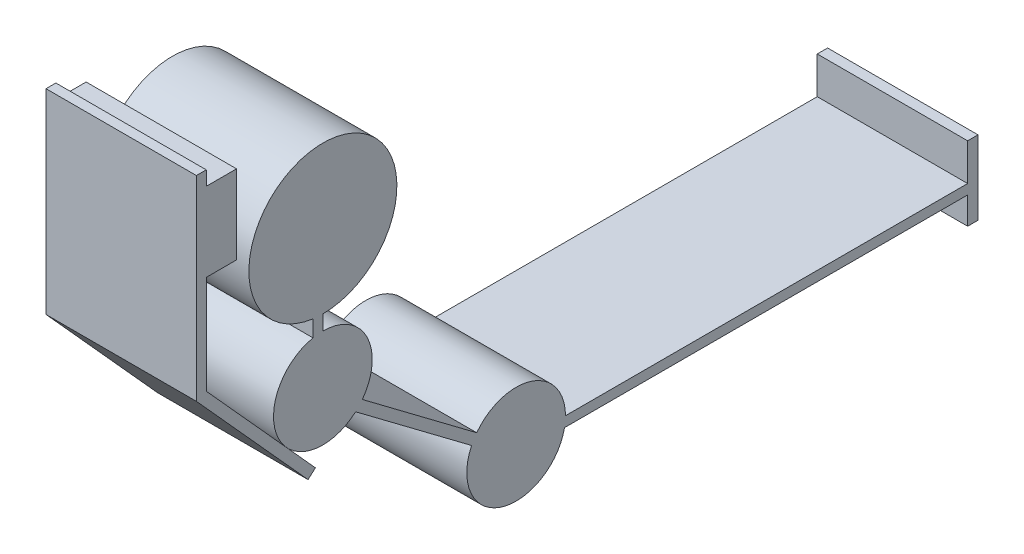
ISO-10303-21;
HEADER;
FILE_DESCRIPTION(('STEP AP214'),'2;1');
FILE_NAME('part.step','',(''),(''),'','','');
FILE_SCHEMA(('AUTOMOTIVE_DESIGN { 1 0 10303 214 1 1 1 1 }'));
ENDSEC;
DATA;
#1=APPLICATION_CONTEXT('core data for automotive mechanical design processes');
#2=APPLICATION_PROTOCOL_DEFINITION('international standard','automotive_design',2000,#1);
#3=PRODUCT_CONTEXT('',#1,'mechanical');
#4=PRODUCT('Part','Part','',(#3));
#5=PRODUCT_RELATED_PRODUCT_CATEGORY('part','',(#4));
#6=PRODUCT_DEFINITION_FORMATION('','',#4);
#7=PRODUCT_DEFINITION_CONTEXT('part definition',#1,'design');
#8=PRODUCT_DEFINITION('design','',#6,#7);
#9=PRODUCT_DEFINITION_SHAPE('','',#8);
#10=(LENGTH_UNIT() NAMED_UNIT(*) SI_UNIT(.MILLI.,.METRE.));
#11=(NAMED_UNIT(*) PLANE_ANGLE_UNIT() SI_UNIT($,.RADIAN.));
#12=(NAMED_UNIT(*) SI_UNIT($,.STERADIAN.) SOLID_ANGLE_UNIT());
#13=UNCERTAINTY_MEASURE_WITH_UNIT(LENGTH_MEASURE(1.E-05),#10,'distance_accuracy_value','');
#14=(GEOMETRIC_REPRESENTATION_CONTEXT(3) GLOBAL_UNCERTAINTY_ASSIGNED_CONTEXT((#13)) GLOBAL_UNIT_ASSIGNED_CONTEXT((#10,
#11,#12)) REPRESENTATION_CONTEXT('',''));
#15=CARTESIAN_POINT('',(0.,0.,0.));
#16=DIRECTION('',(0.,0.,1.));
#17=DIRECTION('',(1.,0.,0.));
#18=AXIS2_PLACEMENT_3D('',#15,#16,#17);
#19=CARTESIAN_POINT('',(304.8,0.,788.372890289523));
#20=DIRECTION('',(0.,0.,-1.));
#21=DIRECTION('',(-1.,0.,0.));
#22=AXIS2_PLACEMENT_3D('',#19,#20,#21);
#23=PLANE('',#22);
#24=DIRECTION('',(0.,-1.,0.));
#25=VECTOR('',#24,1.);
#26=CARTESIAN_POINT('',(0.,0.,788.372890289523));
#27=LINE('',#26,#25);
#28=CARTESIAN_POINT('',(0.,188.904441864782,788.372890289523));
#29=VERTEX_POINT('',#28);
#30=CARTESIAN_POINT('',(0.,158.904441864782,788.372890289523));
#31=VERTEX_POINT('',#30);
#32=EDGE_CURVE('E310',#29,#31,#27,.T.);
#33=ORIENTED_EDGE('',*,*,#32,.F.);
#34=DIRECTION('',(-1.,0.,0.));
#35=VECTOR('',#34,1.);
#36=CARTESIAN_POINT('',(304.8,188.904441864782,788.372890289523));
#37=LINE('',#36,#35);
#38=CARTESIAN_POINT('',(304.8,188.904441864782,788.372890289523));
#39=VERTEX_POINT('',#38);
#40=EDGE_CURVE('E341',#39,#29,#37,.T.);
#41=ORIENTED_EDGE('',*,*,#40,.F.);
#42=DIRECTION('',(0.,-1.,0.));
#43=VECTOR('',#42,1.);
#44=CARTESIAN_POINT('',(304.8,0.,788.372890289523));
#45=LINE('',#44,#43);
#46=CARTESIAN_POINT('',(304.8,158.904441864782,788.372890289523));
#47=VERTEX_POINT('',#46);
#48=EDGE_CURVE('E308',#39,#47,#45,.T.);
#49=ORIENTED_EDGE('',*,*,#48,.T.);
#50=DIRECTION('',(-1.,0.,0.));
#51=VECTOR('',#50,1.);
#52=CARTESIAN_POINT('',(304.8,158.904441864782,788.372890289523));
#53=LINE('',#52,#51);
#54=EDGE_CURVE('E339',#47,#31,#53,.T.);
#55=ORIENTED_EDGE('',*,*,#54,.T.);
#56=EDGE_LOOP('',(#33,#41,#49,#55));
#57=FACE_BOUND('',#56,.T.);
#58=ADVANCED_FACE('F182',(#57),#23,.T.);
#59=CARTESIAN_POINT('',(304.8,58.9044418647818,788.372890289523));
#60=DIRECTION('',(-1.,0.,0.));
#61=DIRECTION('',(0.,0.,1.));
#62=AXIS2_PLACEMENT_3D('',#59,#60,#61);
#63=CYLINDRICAL_SURFACE('',#62,100.);
#64=CARTESIAN_POINT('',(0.,58.9044418647818,788.372890289523));
#65=DIRECTION('',(1.,0.,0.));
#66=DIRECTION('',(0.,0.,-1.));
#67=AXIS2_PLACEMENT_3D('',#64,#65,#66);
#68=CIRCLE('',#67,100.);
#69=CARTESIAN_POINT('',(0.,-1.18830713719755,708.442536121753));
#70=VERTEX_POINT('',#69);
#71=EDGE_CURVE('E345',#70,#31,#68,.T.);
#72=ORIENTED_EDGE('',*,*,#71,.T.);
#73=ORIENTED_EDGE('',*,*,#54,.F.);
#74=CARTESIAN_POINT('',(304.8,58.9044418647818,788.372890289523));
#75=DIRECTION('',(1.,0.,0.));
#76=DIRECTION('',(0.,0.,-1.));
#77=AXIS2_PLACEMENT_3D('',#74,#75,#76);
#78=CIRCLE('',#77,100.);
#79=CARTESIAN_POINT('',(304.8,-1.18830713719755,708.442536121753));
#80=VERTEX_POINT('',#79);
#81=EDGE_CURVE('E371',#80,#47,#78,.T.);
#82=ORIENTED_EDGE('',*,*,#81,.F.);
#83=DIRECTION('',(-1.,0.,0.));
#84=VECTOR('',#83,1.);
#85=CARTESIAN_POINT('',(304.8,-1.18830713719755,708.442536121753));
#86=LINE('',#85,#84);
#87=EDGE_CURVE('E337',#80,#70,#86,.T.);
#88=ORIENTED_EDGE('',*,*,#87,.T.);
#89=EDGE_LOOP('',(#72,#73,#82,#88));
#90=FACE_BOUND('',#89,.T.);
#91=ADVANCED_FACE('F466',(#90),#63,.T.);
#92=CARTESIAN_POINT('',(304.8,-341.040770973571,256.399182299884));
#93=DIRECTION('',(0.,0.799303541677698,-0.600927490019793));
#94=DIRECTION('',(0.,0.600927490019793,0.799303541677698));
#95=AXIS2_PLACEMENT_3D('',#92,#93,#94);
#96=PLANE('',#95);
#97=DIRECTION('',(0.,-0.600927490019793,-0.799303541677698));
#98=VECTOR('',#97,1.);
#99=CARTESIAN_POINT('',(0.,-341.040770973571,256.399182299884));
#100=LINE('',#99,#98);
#101=CARTESIAN_POINT('',(0.,-175.457279242937,476.644509035221));
#102=VERTEX_POINT('',#101);
#103=EDGE_CURVE('E348',#70,#102,#100,.T.);
#104=ORIENTED_EDGE('',*,*,#103,.F.);
#105=ORIENTED_EDGE('',*,*,#87,.F.);
#106=DIRECTION('',(0.,-0.600927490019793,-0.799303541677698));
#107=VECTOR('',#106,1.);
#108=CARTESIAN_POINT('',(304.8,-341.040770973571,256.399182299884));
#109=LINE('',#108,#107);
#110=CARTESIAN_POINT('',(304.8,-175.457279242937,476.644509035221));
#111=VERTEX_POINT('',#110);
#112=EDGE_CURVE('E373',#80,#111,#109,.T.);
#113=ORIENTED_EDGE('',*,*,#112,.T.);
#114=DIRECTION('',(-1.,0.,0.));
#115=VECTOR('',#114,1.);
#116=CARTESIAN_POINT('',(304.8,-175.457279242937,476.644509035221));
#117=LINE('',#116,#115);
#118=EDGE_CURVE('E335',#111,#102,#117,.T.);
#119=ORIENTED_EDGE('',*,*,#118,.T.);
#120=EDGE_LOOP('',(#104,#105,#113,#119));
#121=FACE_BOUND('',#120,.T.);
#122=ADVANCED_FACE('F472',(#121),#96,.T.);
#123=CARTESIAN_POINT('',(304.8,338.904441864782,788.372890289523));
#124=DIRECTION('',(-1.,0.,0.));
#125=DIRECTION('',(0.,0.,1.));
#126=AXIS2_PLACEMENT_3D('',#123,#124,#125);
#127=CYLINDRICAL_SURFACE('',#126,150.);
#128=CARTESIAN_POINT('',(0.,338.904441864782,788.372890289523));
#129=DIRECTION('',(1.,0.,0.));
#130=DIRECTION('',(0.,0.,-1.));
#131=AXIS2_PLACEMENT_3D('',#128,#129,#130);
#132=CIRCLE('',#131,150.);
#133=CARTESIAN_POINT('',(0.,190.243754391597,808.372890289523));
#134=VERTEX_POINT('',#133);
#135=EDGE_CURVE('E313',#29,#134,#132,.T.);
#136=ORIENTED_EDGE('',*,*,#135,.T.);
#137=DIRECTION('',(-1.,0.,0.));
#138=VECTOR('',#137,1.);
#139=CARTESIAN_POINT('',(304.8,190.243754391597,808.372890289523));
#140=LINE('',#139,#138);
#141=CARTESIAN_POINT('',(304.8,190.243754391597,808.372890289523));
#142=VERTEX_POINT('',#141);
#143=EDGE_CURVE('E301',#142,#134,#140,.T.);
#144=ORIENTED_EDGE('',*,*,#143,.F.);
#145=CARTESIAN_POINT('',(304.8,338.904441864782,788.372890289523));
#146=DIRECTION('',(1.,0.,0.));
#147=DIRECTION('',(0.,0.,-1.));
#148=AXIS2_PLACEMENT_3D('',#145,#146,#147);
#149=CIRCLE('',#148,150.);
#150=EDGE_CURVE('E186',#39,#142,#149,.T.);
#151=ORIENTED_EDGE('',*,*,#150,.F.);
#152=ORIENTED_EDGE('',*,*,#40,.T.);
#153=EDGE_LOOP('',(#136,#144,#151,#152));
#154=FACE_BOUND('',#153,.T.);
#155=ADVANCED_FACE('F311',(#154),#127,.T.);
#156=CARTESIAN_POINT('',(304.8,-235.550028244917,396.714154867451));
#157=DIRECTION('',(-1.,0.,0.));
#158=DIRECTION('',(0.,0.,1.));
#159=AXIS2_PLACEMENT_3D('',#156,#157,#158);
#160=CYLINDRICAL_SURFACE('',#159,100.);
#161=CARTESIAN_POINT('',(0.,-235.550028244917,396.714154867451));
#162=DIRECTION('',(1.,0.,0.));
#163=DIRECTION('',(0.,0.,-1.));
#164=AXIS2_PLACEMENT_3D('',#161,#162,#163);
#165=CIRCLE('',#164,100.);
#166=CARTESIAN_POINT('',(0.,-235.550028244917,296.714154867451));
#167=VERTEX_POINT('',#166);
#168=EDGE_CURVE('E351',#167,#102,#165,.T.);
#169=ORIENTED_EDGE('',*,*,#168,.T.);
#170=ORIENTED_EDGE('',*,*,#118,.F.);
#171=CARTESIAN_POINT('',(304.8,-235.550028244917,396.714154867451));
#172=DIRECTION('',(1.,0.,0.));
#173=DIRECTION('',(0.,0.,-1.));
#174=AXIS2_PLACEMENT_3D('',#171,#172,#173);
#175=CIRCLE('',#174,100.);
#176=CARTESIAN_POINT('',(304.8,-235.550028244917,296.714154867451));
#177=VERTEX_POINT('',#176);
#178=EDGE_CURVE('E376',#177,#111,#175,.T.);
#179=ORIENTED_EDGE('',*,*,#178,.F.);
#180=DIRECTION('',(-1.,0.,0.));
#181=VECTOR('',#180,1.);
#182=CARTESIAN_POINT('',(304.8,-235.550028244917,296.714154867451));
#183=LINE('',#182,#181);
#184=EDGE_CURVE('E333',#177,#167,#183,.T.);
#185=ORIENTED_EDGE('',*,*,#184,.T.);
#186=EDGE_LOOP('',(#169,#170,#179,#185));
#187=FACE_BOUND('',#186,.T.);
#188=ADVANCED_FACE('F491',(#187),#160,.T.);
#189=CARTESIAN_POINT('',(304.8,-235.550028244917,396.714154867451));
#190=DIRECTION('',(-1.,0.,0.));
#191=DIRECTION('',(0.,0.,1.));
#192=AXIS2_PLACEMENT_3D('',#189,#190,#191);
#193=CYLINDRICAL_SURFACE('',#192,100.);
#194=CARTESIAN_POINT('',(0.,-235.550028244917,396.714154867451));
#195=DIRECTION('',(1.,0.,0.));
#196=DIRECTION('',(0.,0.,-1.));
#197=AXIS2_PLACEMENT_3D('',#194,#195,#196);
#198=CIRCLE('',#197,100.);
#199=CARTESIAN_POINT('',(0.,-192.657470160074,487.048137736238));
#200=VERTEX_POINT('',#199);
#201=CARTESIAN_POINT('',(0.,-255.550028244917,298.734565156124));
#202=VERTEX_POINT('',#201);
#203=EDGE_CURVE('E360',#200,#202,#198,.T.);
#204=ORIENTED_EDGE('',*,*,#203,.T.);
#205=DIRECTION('',(-1.,0.,0.));
#206=VECTOR('',#205,1.);
#207=CARTESIAN_POINT('',(304.8,-255.550028244917,298.734565156124));
#208=LINE('',#207,#206);
#209=CARTESIAN_POINT('',(304.8,-255.550028244917,298.734565156124));
#210=VERTEX_POINT('',#209);
#211=EDGE_CURVE('E326',#210,#202,#208,.T.);
#212=ORIENTED_EDGE('',*,*,#211,.F.);
#213=CARTESIAN_POINT('',(304.8,-235.550028244917,396.714154867451));
#214=DIRECTION('',(1.,0.,0.));
#215=DIRECTION('',(0.,0.,-1.));
#216=AXIS2_PLACEMENT_3D('',#213,#214,#215);
#217=CIRCLE('',#216,100.);
#218=CARTESIAN_POINT('',(304.8,-192.657470160074,487.048137736238));
#219=VERTEX_POINT('',#218);
#220=EDGE_CURVE('E384',#219,#210,#217,.T.);
#221=ORIENTED_EDGE('',*,*,#220,.F.);
#222=DIRECTION('',(-1.,0.,0.));
#223=VECTOR('',#222,1.);
#224=CARTESIAN_POINT('',(304.8,-192.657470160074,487.048137736238));
#225=LINE('',#224,#223);
#226=EDGE_CURVE('E323',#219,#200,#225,.T.);
#227=ORIENTED_EDGE('',*,*,#226,.T.);
#228=EDGE_LOOP('',(#204,#212,#221,#227));
#229=FACE_BOUND('',#228,.T.);
#230=ADVANCED_FACE('F398',(#229),#193,.T.);
#231=CARTESIAN_POINT('',(304.8,0.,808.372890289523));
#232=DIRECTION('',(0.,0.,-1.));
#233=DIRECTION('',(-1.,0.,0.));
#234=AXIS2_PLACEMENT_3D('',#231,#232,#233);
#235=PLANE('',#234);
#236=DIRECTION('',(0.,-1.,0.));
#237=VECTOR('',#236,1.);
#238=CARTESIAN_POINT('',(0.,0.,808.372890289523));
#239=LINE('',#238,#237);
#240=CARTESIAN_POINT('',(0.,156.884031576109,808.372890289523));
#241=VERTEX_POINT('',#240);
#242=EDGE_CURVE('E366',#134,#241,#239,.T.);
#243=ORIENTED_EDGE('',*,*,#242,.T.);
#244=DIRECTION('',(-1.,0.,0.));
#245=VECTOR('',#244,1.);
#246=CARTESIAN_POINT('',(304.8,156.884031576109,808.372890289523));
#247=LINE('',#246,#245);
#248=CARTESIAN_POINT('',(304.8,156.884031576109,808.372890289523));
#249=VERTEX_POINT('',#248);
#250=EDGE_CURVE('E303',#249,#241,#247,.T.);
#251=ORIENTED_EDGE('',*,*,#250,.F.);
#252=DIRECTION('',(0.,-1.,0.));
#253=VECTOR('',#252,1.);
#254=CARTESIAN_POINT('',(304.8,0.,808.372890289523));
#255=LINE('',#254,#253);
#256=EDGE_CURVE('E296',#142,#249,#255,.T.);
#257=ORIENTED_EDGE('',*,*,#256,.F.);
#258=ORIENTED_EDGE('',*,*,#143,.T.);
#259=EDGE_LOOP('',(#243,#251,#257,#258));
#260=FACE_BOUND('',#259,.T.);
#261=ADVANCED_FACE('F299',(#260),#235,.F.);
#262=CARTESIAN_POINT('',(304.8,-357.026841807125,268.41773210028));
#263=DIRECTION('',(0.,0.799303541677698,-0.600927490019793));
#264=DIRECTION('',(0.,0.600927490019793,0.799303541677698));
#265=AXIS2_PLACEMENT_3D('',#262,#263,#264);
#266=PLANE('',#265);
#267=DIRECTION('',(0.,-0.600927490019793,-0.799303541677698));
#268=VECTOR('',#267,1.);
#269=CARTESIAN_POINT('',(0.,-357.026841807125,268.41773210028));
#270=LINE('',#269,#268);
#271=CARTESIAN_POINT('',(0.,-15.9602578871692,722.076007021527));
#272=VERTEX_POINT('',#271);
#273=EDGE_CURVE('E362',#272,#200,#270,.T.);
#274=ORIENTED_EDGE('',*,*,#273,.T.);
#275=ORIENTED_EDGE('',*,*,#226,.F.);
#276=DIRECTION('',(0.,-0.600927490019793,-0.799303541677698));
#277=VECTOR('',#276,1.);
#278=CARTESIAN_POINT('',(304.8,-357.026841807125,268.41773210028));
#279=LINE('',#278,#277);
#280=CARTESIAN_POINT('',(304.8,-15.9602578871692,722.076007021527));
#281=VERTEX_POINT('',#280);
#282=EDGE_CURVE('E386',#281,#219,#279,.T.);
#283=ORIENTED_EDGE('',*,*,#282,.F.);
#284=DIRECTION('',(-1.,0.,0.));
#285=VECTOR('',#284,1.);
#286=CARTESIAN_POINT('',(304.8,-15.9602578871692,722.076007021527));
#287=LINE('',#286,#285);
#288=EDGE_CURVE('E315',#281,#272,#287,.T.);
#289=ORIENTED_EDGE('',*,*,#288,.T.);
#290=EDGE_LOOP('',(#274,#275,#283,#289));
#291=FACE_BOUND('',#290,.T.);
#292=ADVANCED_FACE('F393',(#291),#266,.F.);
#293=CARTESIAN_POINT('',(0.,0.,0.));
#294=DIRECTION('',(1.,0.,0.));
#295=DIRECTION('',(0.,0.,-1.));
#296=AXIS2_PLACEMENT_3D('',#293,#294,#295);
#297=PLANE('',#296);
#298=ORIENTED_EDGE('',*,*,#135,.F.);
#299=ORIENTED_EDGE('',*,*,#32,.T.);
#300=ORIENTED_EDGE('',*,*,#71,.F.);
#301=ORIENTED_EDGE('',*,*,#103,.T.);
#302=ORIENTED_EDGE('',*,*,#168,.F.);
#303=DIRECTION('',(0.,0.,-1.));
#304=VECTOR('',#303,1.);
#305=CARTESIAN_POINT('',(0.,-235.550028244917,0.));
#306=LINE('',#305,#304);
#307=CARTESIAN_POINT('',(0.,-235.550028244917,-518.285845132549));
#308=VERTEX_POINT('',#307);
#309=EDGE_CURVE('E354',#167,#308,#306,.T.);
#310=ORIENTED_EDGE('',*,*,#309,.T.);
#311=DIRECTION('',(0.,-1.,0.));
#312=VECTOR('',#311,1.);
#313=CARTESIAN_POINT('',(0.,-160.550028244917,-518.285845132549));
#314=LINE('',#313,#312);
#315=CARTESIAN_POINT('',(0.,-160.550028244917,-518.285845132549));
#316=VERTEX_POINT('',#315);
#317=EDGE_CURVE('E424',#316,#308,#314,.T.);
#318=ORIENTED_EDGE('',*,*,#317,.F.);
#319=DIRECTION('',(0.,0.,-1.));
#320=VECTOR('',#319,1.);
#321=CARTESIAN_POINT('',(0.,-160.550028244917,-518.285845132549));
#322=LINE('',#321,#320);
#323=CARTESIAN_POINT('',(0.,-160.550028244917,-539.267073435126));
#324=VERTEX_POINT('',#323);
#325=EDGE_CURVE('E427',#316,#324,#322,.T.);
#326=ORIENTED_EDGE('',*,*,#325,.T.);
#327=DIRECTION('',(0.,-1.,0.));
#328=VECTOR('',#327,1.);
#329=CARTESIAN_POINT('',(0.,-160.550028244917,-539.267073435126));
#330=LINE('',#329,#328);
#331=CARTESIAN_POINT('',(0.,-310.550028244917,-539.267073435126));
#332=VERTEX_POINT('',#331);
#333=EDGE_CURVE('E13',#324,#332,#330,.T.);
#334=ORIENTED_EDGE('',*,*,#333,.T.);
#335=DIRECTION('',(0.,0.,1.));
#336=VECTOR('',#335,1.);
#337=CARTESIAN_POINT('',(0.,-310.550028244917,-539.267073435126));
#338=LINE('',#337,#336);
#339=CARTESIAN_POINT('',(0.,-310.550028244917,-518.285845132549));
#340=VERTEX_POINT('',#339);
#341=EDGE_CURVE('E192',#332,#340,#338,.T.);
#342=ORIENTED_EDGE('',*,*,#341,.T.);
#343=CARTESIAN_POINT('',(0.,-255.550028244917,-518.285845132549));
#344=VERTEX_POINT('',#343);
#345=EDGE_CURVE('E423',#344,#340,#314,.T.);
#346=ORIENTED_EDGE('',*,*,#345,.F.);
#347=DIRECTION('',(0.,0.,-1.));
#348=VECTOR('',#347,1.);
#349=CARTESIAN_POINT('',(0.,-255.550028244917,0.));
#350=LINE('',#349,#348);
#351=EDGE_CURVE('E357',#202,#344,#350,.T.);
#352=ORIENTED_EDGE('',*,*,#351,.F.);
#353=ORIENTED_EDGE('',*,*,#203,.F.);
#354=ORIENTED_EDGE('',*,*,#273,.F.);
#355=CARTESIAN_POINT('',(0.,58.9044418647818,788.372890289523));
#356=DIRECTION('',(1.,0.,0.));
#357=DIRECTION('',(0.,0.,-1.));
#358=AXIS2_PLACEMENT_3D('',#355,#356,#357);
#359=CIRCLE('',#358,100.);
#360=EDGE_CURVE('E364',#241,#272,#359,.T.);
#361=ORIENTED_EDGE('',*,*,#360,.F.);
#362=ORIENTED_EDGE('',*,*,#242,.F.);
#363=EDGE_LOOP('',(#298,#299,#300,#301,#302,#310,#318,#326,#334,#342,#346,#352,#353,#354,#361,#362));
#364=FACE_BOUND('',#363,.T.);
#365=ADVANCED_FACE('F439',(#364),#297,.F.);
#366=CARTESIAN_POINT('',(304.8,0.,0.));
#367=DIRECTION('',(1.,0.,0.));
#368=DIRECTION('',(0.,0.,-1.));
#369=AXIS2_PLACEMENT_3D('',#366,#367,#368);
#370=PLANE('',#369);
#371=ORIENTED_EDGE('',*,*,#150,.T.);
#372=ORIENTED_EDGE('',*,*,#256,.T.);
#373=CARTESIAN_POINT('',(304.8,58.9044418647818,788.372890289523));
#374=DIRECTION('',(1.,0.,0.));
#375=DIRECTION('',(0.,0.,-1.));
#376=AXIS2_PLACEMENT_3D('',#373,#374,#375);
#377=CIRCLE('',#376,100.);
#378=EDGE_CURVE('E290',#249,#281,#377,.T.);
#379=ORIENTED_EDGE('',*,*,#378,.T.);
#380=ORIENTED_EDGE('',*,*,#282,.T.);
#381=ORIENTED_EDGE('',*,*,#220,.T.);
#382=DIRECTION('',(0.,0.,-1.));
#383=VECTOR('',#382,1.);
#384=CARTESIAN_POINT('',(304.8,-255.550028244917,0.));
#385=LINE('',#384,#383);
#386=CARTESIAN_POINT('',(304.8,-255.550028244917,-518.285845132549));
#387=VERTEX_POINT('',#386);
#388=EDGE_CURVE('E381',#210,#387,#385,.T.);
#389=ORIENTED_EDGE('',*,*,#388,.T.);
#390=DIRECTION('',(0.,-1.,0.));
#391=VECTOR('',#390,1.);
#392=CARTESIAN_POINT('',(304.8,-160.550028244917,-518.285845132549));
#393=LINE('',#392,#391);
#394=CARTESIAN_POINT('',(304.8,-310.550028244917,-518.285845132549));
#395=VERTEX_POINT('',#394);
#396=EDGE_CURVE('E402',#387,#395,#393,.T.);
#397=ORIENTED_EDGE('',*,*,#396,.T.);
#398=DIRECTION('',(0.,0.,1.));
#399=VECTOR('',#398,1.);
#400=CARTESIAN_POINT('',(304.8,-310.550028244917,-539.267073435126));
#401=LINE('',#400,#399);
#402=CARTESIAN_POINT('',(304.8,-310.550028244917,-539.267073435126));
#403=VERTEX_POINT('',#402);
#404=EDGE_CURVE('E413',#403,#395,#401,.T.);
#405=ORIENTED_EDGE('',*,*,#404,.F.);
#406=DIRECTION('',(0.,-1.,0.));
#407=VECTOR('',#406,1.);
#408=CARTESIAN_POINT('',(304.8,-160.550028244917,-539.267073435126));
#409=LINE('',#408,#407);
#410=CARTESIAN_POINT('',(304.8,-160.550028244917,-539.267073435126));
#411=VERTEX_POINT('',#410);
#412=EDGE_CURVE('E318',#411,#403,#409,.T.);
#413=ORIENTED_EDGE('',*,*,#412,.F.);
#414=DIRECTION('',(0.,0.,-1.));
#415=VECTOR('',#414,1.);
#416=CARTESIAN_POINT('',(304.8,-160.550028244917,-518.285845132549));
#417=LINE('',#416,#415);
#418=CARTESIAN_POINT('',(304.8,-160.550028244917,-518.285845132549));
#419=VERTEX_POINT('',#418);
#420=EDGE_CURVE('E417',#419,#411,#417,.T.);
#421=ORIENTED_EDGE('',*,*,#420,.F.);
#422=CARTESIAN_POINT('',(304.8,-235.550028244917,-518.285845132549));
#423=VERTEX_POINT('',#422);
#424=EDGE_CURVE('E414',#419,#423,#393,.T.);
#425=ORIENTED_EDGE('',*,*,#424,.T.);
#426=DIRECTION('',(0.,0.,-1.));
#427=VECTOR('',#426,1.);
#428=CARTESIAN_POINT('',(304.8,-235.550028244917,0.));
#429=LINE('',#428,#427);
#430=EDGE_CURVE('E378',#177,#423,#429,.T.);
#431=ORIENTED_EDGE('',*,*,#430,.F.);
#432=ORIENTED_EDGE('',*,*,#178,.T.);
#433=ORIENTED_EDGE('',*,*,#112,.F.);
#434=ORIENTED_EDGE('',*,*,#81,.T.);
#435=ORIENTED_EDGE('',*,*,#48,.F.);
#436=EDGE_LOOP('',(#371,#372,#379,#380,#381,#389,#397,#405,#413,#421,#425,#431,#432,#433,#434,#435));
#437=FACE_BOUND('',#436,.T.);
#438=ADVANCED_FACE('F184',(#437),#370,.T.);
#439=CARTESIAN_POINT('',(304.8,58.9044418647818,788.372890289523));
#440=DIRECTION('',(-1.,0.,0.));
#441=DIRECTION('',(0.,0.,1.));
#442=AXIS2_PLACEMENT_3D('',#439,#440,#441);
#443=CYLINDRICAL_SURFACE('',#442,100.);
#444=ORIENTED_EDGE('',*,*,#378,.F.);
#445=ORIENTED_EDGE('',*,*,#250,.T.);
#446=ORIENTED_EDGE('',*,*,#360,.T.);
#447=ORIENTED_EDGE('',*,*,#288,.F.);
#448=EDGE_LOOP('',(#444,#445,#446,#447));
#449=FACE_BOUND('',#448,.T.);
#450=ADVANCED_FACE('F390',(#449),#443,.T.);
#451=CARTESIAN_POINT('',(304.8,-255.550028244917,0.));
#452=DIRECTION('',(0.,1.,0.));
#453=DIRECTION('',(0.,0.,1.));
#454=AXIS2_PLACEMENT_3D('',#451,#452,#453);
#455=PLANE('',#454);
#456=ORIENTED_EDGE('',*,*,#351,.T.);
#457=DIRECTION('',(-1.,0.,0.));
#458=VECTOR('',#457,1.);
#459=CARTESIAN_POINT('',(304.8,-255.550028244917,-518.285845132549));
#460=LINE('',#459,#458);
#461=EDGE_CURVE('E329',#387,#344,#460,.T.);
#462=ORIENTED_EDGE('',*,*,#461,.F.);
#463=ORIENTED_EDGE('',*,*,#388,.F.);
#464=ORIENTED_EDGE('',*,*,#211,.T.);
#465=EDGE_LOOP('',(#456,#462,#463,#464));
#466=FACE_BOUND('',#465,.T.);
#467=ADVANCED_FACE('F405',(#466),#455,.F.);
#468=CARTESIAN_POINT('',(304.8,-235.550028244917,0.));
#469=DIRECTION('',(0.,1.,0.));
#470=DIRECTION('',(0.,0.,1.));
#471=AXIS2_PLACEMENT_3D('',#468,#469,#470);
#472=PLANE('',#471);
#473=ORIENTED_EDGE('',*,*,#309,.F.);
#474=ORIENTED_EDGE('',*,*,#184,.F.);
#475=ORIENTED_EDGE('',*,*,#430,.T.);
#476=DIRECTION('',(-1.,0.,0.));
#477=VECTOR('',#476,1.);
#478=CARTESIAN_POINT('',(304.8,-235.550028244917,-518.285845132549));
#479=LINE('',#478,#477);
#480=EDGE_CURVE('E331',#423,#308,#479,.T.);
#481=ORIENTED_EDGE('',*,*,#480,.T.);
#482=EDGE_LOOP('',(#473,#474,#475,#481));
#483=FACE_BOUND('',#482,.T.);
#484=ADVANCED_FACE('F460',(#483),#472,.T.);
#485=CARTESIAN_POINT('',(304.8,-160.550028244917,-539.267073435126));
#486=DIRECTION('',(0.,0.,-1.));
#487=DIRECTION('',(-1.,0.,0.));
#488=AXIS2_PLACEMENT_3D('',#485,#486,#487);
#489=PLANE('',#488);
#490=ORIENTED_EDGE('',*,*,#333,.F.);
#491=DIRECTION('',(-1.,0.,0.));
#492=VECTOR('',#491,1.);
#493=CARTESIAN_POINT('',(304.8,-160.550028244917,-539.267073435126));
#494=LINE('',#493,#492);
#495=EDGE_CURVE('E369',#411,#324,#494,.T.);
#496=ORIENTED_EDGE('',*,*,#495,.F.);
#497=ORIENTED_EDGE('',*,*,#412,.T.);
#498=DIRECTION('',(-1.,0.,0.));
#499=VECTOR('',#498,1.);
#500=CARTESIAN_POINT('',(304.8,-310.550028244917,-539.267073435126));
#501=LINE('',#500,#499);
#502=EDGE_CURVE('E201',#403,#332,#501,.T.);
#503=ORIENTED_EDGE('',*,*,#502,.T.);
#504=EDGE_LOOP('',(#490,#496,#497,#503));
#505=FACE_BOUND('',#504,.T.);
#506=ADVANCED_FACE('F442',(#505),#489,.T.);
#507=CARTESIAN_POINT('',(304.8,-160.550028244917,-518.285845132549));
#508=DIRECTION('',(0.,1.,0.));
#509=DIRECTION('',(0.,0.,1.));
#510=AXIS2_PLACEMENT_3D('',#507,#508,#509);
#511=PLANE('',#510);
#512=ORIENTED_EDGE('',*,*,#325,.F.);
#513=DIRECTION('',(-1.,0.,0.));
#514=VECTOR('',#513,1.);
#515=CARTESIAN_POINT('',(304.8,-160.550028244917,-518.285845132549));
#516=LINE('',#515,#514);
#517=EDGE_CURVE('E432',#419,#316,#516,.T.);
#518=ORIENTED_EDGE('',*,*,#517,.F.);
#519=ORIENTED_EDGE('',*,*,#420,.T.);
#520=ORIENTED_EDGE('',*,*,#495,.T.);
#521=EDGE_LOOP('',(#512,#518,#519,#520));
#522=FACE_BOUND('',#521,.T.);
#523=ADVANCED_FACE('F452',(#522),#511,.T.);
#524=CARTESIAN_POINT('',(304.8,-310.550028244917,-539.267073435126));
#525=DIRECTION('',(0.,-1.,0.));
#526=DIRECTION('',(0.,0.,-1.));
#527=AXIS2_PLACEMENT_3D('',#524,#525,#526);
#528=PLANE('',#527);
#529=ORIENTED_EDGE('',*,*,#341,.F.);
#530=ORIENTED_EDGE('',*,*,#502,.F.);
#531=ORIENTED_EDGE('',*,*,#404,.T.);
#532=DIRECTION('',(-1.,0.,0.));
#533=VECTOR('',#532,1.);
#534=CARTESIAN_POINT('',(304.8,-310.550028244917,-518.285845132549));
#535=LINE('',#534,#533);
#536=EDGE_CURVE('E411',#395,#340,#535,.T.);
#537=ORIENTED_EDGE('',*,*,#536,.T.);
#538=EDGE_LOOP('',(#529,#530,#531,#537));
#539=FACE_BOUND('',#538,.T.);
#540=ADVANCED_FACE('F437',(#539),#528,.T.);
#541=CARTESIAN_POINT('',(304.8,-160.550028244917,-518.285845132549));
#542=DIRECTION('',(0.,0.,-1.));
#543=DIRECTION('',(-1.,0.,0.));
#544=AXIS2_PLACEMENT_3D('',#541,#542,#543);
#545=PLANE('',#544);
#546=ORIENTED_EDGE('',*,*,#396,.F.);
#547=ORIENTED_EDGE('',*,*,#461,.T.);
#548=ORIENTED_EDGE('',*,*,#345,.T.);
#549=ORIENTED_EDGE('',*,*,#536,.F.);
#550=EDGE_LOOP('',(#546,#547,#548,#549));
#551=FACE_BOUND('',#550,.T.);
#552=ADVANCED_FACE('F409',(#551),#545,.F.);
#553=ORIENTED_EDGE('',*,*,#480,.F.);
#554=ORIENTED_EDGE('',*,*,#424,.F.);
#555=ORIENTED_EDGE('',*,*,#517,.T.);
#556=ORIENTED_EDGE('',*,*,#317,.T.);
#557=EDGE_LOOP('',(#553,#554,#555,#556));
#558=FACE_BOUND('',#557,.T.);
#559=ADVANCED_FACE('F448',(#558),#545,.F.);
#560=CLOSED_SHELL('',(#58,#91,#122,#155,#188,#230,#261,#292,#365,#438,#450,#467,#484,#506,#523,
#540,#552,#559));
#561=MANIFOLD_SOLID_BREP('B2',#560);
#562=CARTESIAN_POINT('',(304.8,171.391607246087,1024.68874642515));
#563=DIRECTION('',(0.,0.67020040640593,-0.742180177081904));
#564=DIRECTION('',(0.,0.742180177081904,0.67020040640593));
#565=AXIS2_PLACEMENT_3D('',#562,#563,#564);
#566=PLANE('',#565);
#567=DIRECTION('',(-1.,0.,0.));
#568=VECTOR('',#567,1.);
#569=CARTESIAN_POINT('',(304.8,-73.5202398105865,803.529485507709));
#570=LINE('',#569,#568);
#571=CARTESIAN_POINT('',(304.8,-73.5202398105865,803.529485507709));
#572=VERTEX_POINT('',#571);
#573=CARTESIAN_POINT('',(0.,-73.5202398105865,803.529485507709));
#574=VERTEX_POINT('',#573);
#575=EDGE_CURVE('E772',#572,#574,#570,.T.);
#576=ORIENTED_EDGE('',*,*,#575,.T.);
#577=DIRECTION('',(0.,-0.742180177081904,-0.67020040640593));
#578=VECTOR('',#577,1.);
#579=CARTESIAN_POINT('',(0.,171.391607246087,1024.68874642515));
#580=LINE('',#579,#578);
#581=CARTESIAN_POINT('',(0.,171.391607246087,1024.68874642515));
#582=VERTEX_POINT('',#581);
#583=EDGE_CURVE('E756',#582,#574,#580,.T.);
#584=ORIENTED_EDGE('',*,*,#583,.F.);
#585=DIRECTION('',(-1.,0.,0.));
#586=VECTOR('',#585,1.);
#587=CARTESIAN_POINT('',(304.8,171.391607246087,1024.68874642515));
#588=LINE('',#587,#586);
#589=CARTESIAN_POINT('',(304.8,171.391607246087,1024.68874642515));
#590=VERTEX_POINT('',#589);
#591=EDGE_CURVE('E770',#590,#582,#588,.T.);
#592=ORIENTED_EDGE('',*,*,#591,.F.);
#593=DIRECTION('',(0.,-0.742180177081904,-0.67020040640593));
#594=VECTOR('',#593,1.);
#595=CARTESIAN_POINT('',(304.8,171.391607246087,1024.68874642515));
#596=LINE('',#595,#594);
#597=EDGE_CURVE('E800',#590,#572,#596,.T.);
#598=ORIENTED_EDGE('',*,*,#597,.T.);
#599=EDGE_LOOP('',(#576,#584,#592,#598));
#600=FACE_BOUND('',#599,.T.);
#601=ADVANCED_FACE('F656',(#600),#566,.T.);
#602=CARTESIAN_POINT('',(304.8,371.220407618039,0.));
#603=DIRECTION('',(0.,-1.,0.));
#604=DIRECTION('',(0.,0.,-1.));
#605=AXIS2_PLACEMENT_3D('',#602,#603,#604);
#606=PLANE('',#605);
#607=DIRECTION('',(0.,0.,1.));
#608=VECTOR('',#607,1.);
#609=CARTESIAN_POINT('',(0.,371.220407618039,0.));
#610=LINE('',#609,#608);
#611=CARTESIAN_POINT('',(0.,371.220407618039,963.372890289523));
#612=VERTEX_POINT('',#611);
#613=CARTESIAN_POINT('',(0.,371.220407618039,1024.68874642515));
#614=VERTEX_POINT('',#613);
#615=EDGE_CURVE('E777',#612,#614,#610,.T.);
#616=ORIENTED_EDGE('',*,*,#615,.F.);
#617=DIRECTION('',(-1.,0.,0.));
#618=VECTOR('',#617,1.);
#619=CARTESIAN_POINT('',(304.8,371.220407618039,963.372890289523));
#620=LINE('',#619,#618);
#621=CARTESIAN_POINT('',(304.8,371.220407618039,963.372890289523));
#622=VERTEX_POINT('',#621);
#623=EDGE_CURVE('E180',#622,#612,#620,.T.);
#624=ORIENTED_EDGE('',*,*,#623,.F.);
#625=DIRECTION('',(0.,0.,1.));
#626=VECTOR('',#625,1.);
#627=CARTESIAN_POINT('',(304.8,371.220407618039,0.));
#628=LINE('',#627,#626);
#629=CARTESIAN_POINT('',(304.8,371.220407618039,1024.68874642515));
#630=VERTEX_POINT('',#629);
#631=EDGE_CURVE('E791',#622,#630,#628,.T.);
#632=ORIENTED_EDGE('',*,*,#631,.T.);
#633=DIRECTION('',(-1.,0.,0.));
#634=VECTOR('',#633,1.);
#635=CARTESIAN_POINT('',(304.8,371.220407618039,1024.68874642515));
#636=LINE('',#635,#634);
#637=EDGE_CURVE('E675',#630,#614,#636,.T.);
#638=ORIENTED_EDGE('',*,*,#637,.T.);
#639=EDGE_LOOP('',(#616,#624,#632,#638));
#640=FACE_BOUND('',#639,.T.);
#641=ADVANCED_FACE('F832',(#640),#606,.T.);
#642=CARTESIAN_POINT('',(304.8,-6.69102392160458E-13,963.372890289523));
#643=DIRECTION('',(0.,0.,-1.));
#644=DIRECTION('',(0.,1.,0.));
#645=AXIS2_PLACEMENT_3D('',#642,#643,#644);
#646=PLANE('',#645);
#647=DIRECTION('',(0.,-1.,0.));
#648=VECTOR('',#647,1.);
#649=CARTESIAN_POINT('',(0.,-6.69102392160458E-13,963.372890289523));
#650=LINE('',#649,#648);
#651=CARTESIAN_POINT('',(0.,531.070196922428,963.372890289523));
#652=VERTEX_POINT('',#651);
#653=EDGE_CURVE('E779',#652,#612,#650,.T.);
#654=ORIENTED_EDGE('',*,*,#653,.F.);
#655=DIRECTION('',(-1.,0.,0.));
#656=VECTOR('',#655,1.);
#657=CARTESIAN_POINT('',(304.8,531.070196922428,963.372890289523));
#658=LINE('',#657,#656);
#659=CARTESIAN_POINT('',(304.8,531.070196922428,963.372890289523));
#660=VERTEX_POINT('',#659);
#661=EDGE_CURVE('E666',#660,#652,#658,.T.);
#662=ORIENTED_EDGE('',*,*,#661,.F.);
#663=DIRECTION('',(0.,-1.,0.));
#664=VECTOR('',#663,1.);
#665=CARTESIAN_POINT('',(304.8,-6.69102392160458E-13,963.372890289523));
#666=LINE('',#665,#664);
#667=EDGE_CURVE('E829',#660,#622,#666,.T.);
#668=ORIENTED_EDGE('',*,*,#667,.T.);
#669=ORIENTED_EDGE('',*,*,#623,.T.);
#670=EDGE_LOOP('',(#654,#662,#668,#669));
#671=FACE_BOUND('',#670,.T.);
#672=ADVANCED_FACE('F827',(#671),#646,.T.);
#673=CARTESIAN_POINT('',(304.8,531.070196922428,0.));
#674=DIRECTION('',(0.,1.,0.));
#675=DIRECTION('',(0.,0.,1.));
#676=AXIS2_PLACEMENT_3D('',#673,#674,#675);
#677=PLANE('',#676);
#678=DIRECTION('',(0.,0.,-1.));
#679=VECTOR('',#678,1.);
#680=CARTESIAN_POINT('',(0.,531.070196922428,0.));
#681=LINE('',#680,#679);
#682=CARTESIAN_POINT('',(0.,531.070196922428,1024.68874642515));
#683=VERTEX_POINT('',#682);
#684=EDGE_CURVE('E783',#683,#652,#681,.T.);
#685=ORIENTED_EDGE('',*,*,#684,.F.);
#686=DIRECTION('',(-1.,0.,0.));
#687=VECTOR('',#686,1.);
#688=CARTESIAN_POINT('',(304.8,531.070196922428,1024.68874642515));
#689=LINE('',#688,#687);
#690=CARTESIAN_POINT('',(304.8,531.070196922428,1024.68874642515));
#691=VERTEX_POINT('',#690);
#692=EDGE_CURVE('E793',#691,#683,#689,.T.);
#693=ORIENTED_EDGE('',*,*,#692,.F.);
#694=DIRECTION('',(0.,0.,-1.));
#695=VECTOR('',#694,1.);
#696=CARTESIAN_POINT('',(304.8,531.070196922428,0.));
#697=LINE('',#696,#695);
#698=EDGE_CURVE('E786',#691,#660,#697,.T.);
#699=ORIENTED_EDGE('',*,*,#698,.T.);
#700=ORIENTED_EDGE('',*,*,#661,.T.);
#701=EDGE_LOOP('',(#685,#693,#699,#700));
#702=FACE_BOUND('',#701,.T.);
#703=ADVANCED_FACE('F822',(#702),#677,.T.);
#704=CARTESIAN_POINT('',(304.8,0.,0.));
#705=DIRECTION('',(1.,0.,0.));
#706=DIRECTION('',(0.,0.,-1.));
#707=AXIS2_PLACEMENT_3D('',#704,#705,#706);
#708=PLANE('',#707);
#709=ORIENTED_EDGE('',*,*,#631,.F.);
#710=ORIENTED_EDGE('',*,*,#667,.F.);
#711=ORIENTED_EDGE('',*,*,#698,.F.);
#712=DIRECTION('',(0.,-1.,0.));
#713=VECTOR('',#712,1.);
#714=CARTESIAN_POINT('',(304.8,559.971929091038,1024.68874642515));
#715=LINE('',#714,#713);
#716=CARTESIAN_POINT('',(304.8,559.971929091038,1024.68874642515));
#717=VERTEX_POINT('',#716);
#718=EDGE_CURVE('E803',#717,#691,#715,.T.);
#719=ORIENTED_EDGE('',*,*,#718,.F.);
#720=DIRECTION('',(0.,0.,-1.));
#721=VECTOR('',#720,1.);
#722=CARTESIAN_POINT('',(304.8,559.971929091038,1044.68874642515));
#723=LINE('',#722,#721);
#724=CARTESIAN_POINT('',(304.8,559.971929091038,1044.68874642515));
#725=VERTEX_POINT('',#724);
#726=EDGE_CURVE('E805',#725,#717,#723,.T.);
#727=ORIENTED_EDGE('',*,*,#726,.F.);
#728=DIRECTION('',(0.,-1.,0.));
#729=VECTOR('',#728,1.);
#730=CARTESIAN_POINT('',(304.8,559.971929091038,1044.68874642515));
#731=LINE('',#730,#729);
#732=CARTESIAN_POINT('',(304.8,163.697794456545,1044.68874642515));
#733=VERTEX_POINT('',#732);
#734=EDGE_CURVE('E746',#725,#733,#731,.T.);
#735=ORIENTED_EDGE('',*,*,#734,.T.);
#736=DIRECTION('',(0.,-0.742180177081904,-0.67020040640593));
#737=VECTOR('',#736,1.);
#738=CARTESIAN_POINT('',(304.8,163.697794456545,1044.68874642515));
#739=LINE('',#738,#737);
#740=CARTESIAN_POINT('',(304.8,-86.9242479387051,818.373089049347));
#741=VERTEX_POINT('',#740);
#742=EDGE_CURVE('E738',#733,#741,#739,.T.);
#743=ORIENTED_EDGE('',*,*,#742,.T.);
#744=DIRECTION('',(0.,0.670200406405931,-0.742180177081903));
#745=VECTOR('',#744,1.);
#746=CARTESIAN_POINT('',(304.8,-86.9242479387051,818.373089049347));
#747=LINE('',#746,#745);
#748=EDGE_CURVE('E797',#741,#572,#747,.T.);
#749=ORIENTED_EDGE('',*,*,#748,.T.);
#750=ORIENTED_EDGE('',*,*,#597,.F.);
#751=EDGE_CURVE('E802',#630,#590,#715,.T.);
#752=ORIENTED_EDGE('',*,*,#751,.F.);
#753=EDGE_LOOP('',(#709,#710,#711,#719,#727,#735,#743,#749,#750,#752));
#754=FACE_BOUND('',#753,.T.);
#755=ADVANCED_FACE('F811',(#754),#708,.T.);
#756=CARTESIAN_POINT('',(0.,0.,0.));
#757=DIRECTION('',(1.,0.,0.));
#758=DIRECTION('',(0.,0.,-1.));
#759=AXIS2_PLACEMENT_3D('',#756,#757,#758);
#760=PLANE('',#759);
#761=ORIENTED_EDGE('',*,*,#615,.T.);
#762=DIRECTION('',(0.,-1.,0.));
#763=VECTOR('',#762,1.);
#764=CARTESIAN_POINT('',(0.,559.971929091038,1024.68874642515));
#765=LINE('',#764,#763);
#766=EDGE_CURVE('E762',#614,#582,#765,.T.);
#767=ORIENTED_EDGE('',*,*,#766,.T.);
#768=ORIENTED_EDGE('',*,*,#583,.T.);
#769=DIRECTION('',(0.,0.670200406405931,-0.742180177081903));
#770=VECTOR('',#769,1.);
#771=CARTESIAN_POINT('',(0.,-86.9242479387051,818.373089049347));
#772=LINE('',#771,#770);
#773=CARTESIAN_POINT('',(0.,-86.9242479387051,818.373089049347));
#774=VERTEX_POINT('',#773);
#775=EDGE_CURVE('E751',#774,#574,#772,.T.);
#776=ORIENTED_EDGE('',*,*,#775,.F.);
#777=DIRECTION('',(0.,-0.742180177081904,-0.67020040640593));
#778=VECTOR('',#777,1.);
#779=CARTESIAN_POINT('',(0.,163.697794456545,1044.68874642515));
#780=LINE('',#779,#778);
#781=CARTESIAN_POINT('',(0.,163.697794456545,1044.68874642515));
#782=VERTEX_POINT('',#781);
#783=EDGE_CURVE('E744',#782,#774,#780,.T.);
#784=ORIENTED_EDGE('',*,*,#783,.F.);
#785=DIRECTION('',(0.,-1.,0.));
#786=VECTOR('',#785,1.);
#787=CARTESIAN_POINT('',(0.,559.971929091038,1044.68874642515));
#788=LINE('',#787,#786);
#789=CARTESIAN_POINT('',(0.,559.971929091038,1044.68874642515));
#790=VERTEX_POINT('',#789);
#791=EDGE_CURVE('E729',#790,#782,#788,.T.);
#792=ORIENTED_EDGE('',*,*,#791,.F.);
#793=DIRECTION('',(0.,0.,-1.));
#794=VECTOR('',#793,1.);
#795=CARTESIAN_POINT('',(0.,559.971929091038,1044.68874642515));
#796=LINE('',#795,#794);
#797=CARTESIAN_POINT('',(0.,559.971929091038,1024.68874642515));
#798=VERTEX_POINT('',#797);
#799=EDGE_CURVE('E739',#790,#798,#796,.T.);
#800=ORIENTED_EDGE('',*,*,#799,.T.);
#801=EDGE_CURVE('E763',#798,#683,#765,.T.);
#802=ORIENTED_EDGE('',*,*,#801,.T.);
#803=ORIENTED_EDGE('',*,*,#684,.T.);
#804=ORIENTED_EDGE('',*,*,#653,.T.);
#805=EDGE_LOOP('',(#761,#767,#768,#776,#784,#792,#800,#802,#803,#804));
#806=FACE_BOUND('',#805,.T.);
#807=ADVANCED_FACE('F749',(#806),#760,.F.);
#808=CARTESIAN_POINT('',(304.8,-86.9242479387051,818.373089049347));
#809=DIRECTION('',(0.,0.742180177081903,0.670200406405931));
#810=DIRECTION('',(0.,-0.670200406405931,0.742180177081903));
#811=AXIS2_PLACEMENT_3D('',#808,#809,#810);
#812=PLANE('',#811);
#813=ORIENTED_EDGE('',*,*,#775,.T.);
#814=ORIENTED_EDGE('',*,*,#575,.F.);
#815=ORIENTED_EDGE('',*,*,#748,.F.);
#816=DIRECTION('',(-1.,0.,0.));
#817=VECTOR('',#816,1.);
#818=CARTESIAN_POINT('',(304.8,-86.9242479387051,818.373089049347));
#819=LINE('',#818,#817);
#820=EDGE_CURVE('E660',#741,#774,#819,.T.);
#821=ORIENTED_EDGE('',*,*,#820,.T.);
#822=EDGE_LOOP('',(#813,#814,#815,#821));
#823=FACE_BOUND('',#822,.T.);
#824=ADVANCED_FACE('F836',(#823),#812,.F.);
#825=CARTESIAN_POINT('',(304.8,559.971929091038,1024.68874642515));
#826=DIRECTION('',(0.,0.,-1.));
#827=DIRECTION('',(-1.,0.,0.));
#828=AXIS2_PLACEMENT_3D('',#825,#826,#827);
#829=PLANE('',#828);
#830=ORIENTED_EDGE('',*,*,#637,.F.);
#831=ORIENTED_EDGE('',*,*,#751,.T.);
#832=ORIENTED_EDGE('',*,*,#591,.T.);
#833=ORIENTED_EDGE('',*,*,#766,.F.);
#834=EDGE_LOOP('',(#830,#831,#832,#833));
#835=FACE_BOUND('',#834,.T.);
#836=ADVANCED_FACE('F833',(#835),#829,.T.);
#837=ORIENTED_EDGE('',*,*,#718,.T.);
#838=ORIENTED_EDGE('',*,*,#692,.T.);
#839=ORIENTED_EDGE('',*,*,#801,.F.);
#840=DIRECTION('',(-1.,0.,0.));
#841=VECTOR('',#840,1.);
#842=CARTESIAN_POINT('',(304.8,559.971929091038,1024.68874642515));
#843=LINE('',#842,#841);
#844=EDGE_CURVE('E768',#717,#798,#843,.T.);
#845=ORIENTED_EDGE('',*,*,#844,.F.);
#846=EDGE_LOOP('',(#837,#838,#839,#845));
#847=FACE_BOUND('',#846,.T.);
#848=ADVANCED_FACE('F817',(#847),#829,.T.);
#849=CARTESIAN_POINT('',(304.8,559.971929091038,1044.68874642515));
#850=DIRECTION('',(0.,1.,0.));
#851=DIRECTION('',(0.,0.,1.));
#852=AXIS2_PLACEMENT_3D('',#849,#850,#851);
#853=PLANE('',#852);
#854=ORIENTED_EDGE('',*,*,#799,.F.);
#855=DIRECTION('',(-1.,0.,0.));
#856=VECTOR('',#855,1.);
#857=CARTESIAN_POINT('',(304.8,559.971929091038,1044.68874642515));
#858=LINE('',#857,#856);
#859=EDGE_CURVE('E726',#725,#790,#858,.T.);
#860=ORIENTED_EDGE('',*,*,#859,.F.);
#861=ORIENTED_EDGE('',*,*,#726,.T.);
#862=ORIENTED_EDGE('',*,*,#844,.T.);
#863=EDGE_LOOP('',(#854,#860,#861,#862));
#864=FACE_BOUND('',#863,.T.);
#865=ADVANCED_FACE('F819',(#864),#853,.T.);
#866=CARTESIAN_POINT('',(304.8,559.971929091038,1044.68874642515));
#867=DIRECTION('',(0.,0.,-1.));
#868=DIRECTION('',(-1.,0.,0.));
#869=AXIS2_PLACEMENT_3D('',#866,#867,#868);
#870=PLANE('',#869);
#871=ORIENTED_EDGE('',*,*,#791,.T.);
#872=DIRECTION('',(-1.,0.,0.));
#873=VECTOR('',#872,1.);
#874=CARTESIAN_POINT('',(304.8,163.697794456545,1044.68874642515));
#875=LINE('',#874,#873);
#876=EDGE_CURVE('E732',#733,#782,#875,.T.);
#877=ORIENTED_EDGE('',*,*,#876,.F.);
#878=ORIENTED_EDGE('',*,*,#734,.F.);
#879=ORIENTED_EDGE('',*,*,#859,.T.);
#880=EDGE_LOOP('',(#871,#877,#878,#879));
#881=FACE_BOUND('',#880,.T.);
#882=ADVANCED_FACE('F731',(#881),#870,.F.);
#883=CARTESIAN_POINT('',(304.8,163.697794456545,1044.68874642515));
#884=DIRECTION('',(0.,0.67020040640593,-0.742180177081904));
#885=DIRECTION('',(0.,0.742180177081904,0.67020040640593));
#886=AXIS2_PLACEMENT_3D('',#883,#884,#885);
#887=PLANE('',#886);
#888=ORIENTED_EDGE('',*,*,#783,.T.);
#889=ORIENTED_EDGE('',*,*,#820,.F.);
#890=ORIENTED_EDGE('',*,*,#742,.F.);
#891=ORIENTED_EDGE('',*,*,#876,.T.);
#892=EDGE_LOOP('',(#888,#889,#890,#891));
#893=FACE_BOUND('',#892,.T.);
#894=ADVANCED_FACE('F658',(#893),#887,.F.);
#895=CLOSED_SHELL('',(#601,#641,#672,#703,#755,#807,#824,#836,#848,#865,#882,#894));
#896=MANIFOLD_SOLID_BREP('B7',#895);
#897=ADVANCED_BREP_SHAPE_REPRESENTATION('',(#18,#561,#896),#14);
#898=SHAPE_DEFINITION_REPRESENTATION(#9,#897);
ENDSEC;
END-ISO-10303-21;
